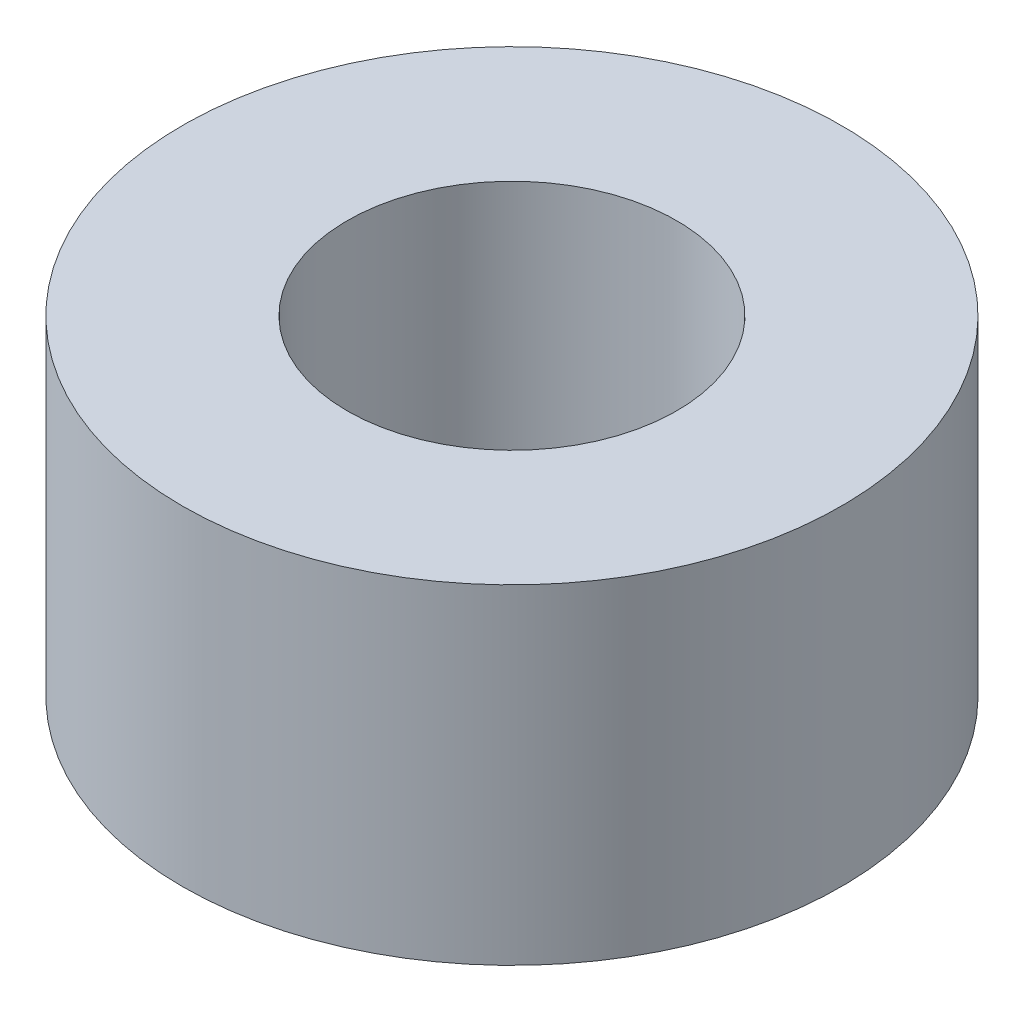
ISO-10303-21;
HEADER;
FILE_DESCRIPTION(('STEP AP214'),'2;1');
FILE_NAME('part.step','',(''),(''),'','','');
FILE_SCHEMA(('AUTOMOTIVE_DESIGN { 1 0 10303 214 1 1 1 1 }'));
ENDSEC;
DATA;
#1=APPLICATION_CONTEXT('core data for automotive mechanical design processes');
#2=APPLICATION_PROTOCOL_DEFINITION('international standard','automotive_design',2000,#1);
#3=PRODUCT_CONTEXT('',#1,'mechanical');
#4=PRODUCT('Part','Part','',(#3));
#5=PRODUCT_RELATED_PRODUCT_CATEGORY('part','',(#4));
#6=PRODUCT_DEFINITION_FORMATION('','',#4);
#7=PRODUCT_DEFINITION_CONTEXT('part definition',#1,'design');
#8=PRODUCT_DEFINITION('design','',#6,#7);
#9=PRODUCT_DEFINITION_SHAPE('','',#8);
#10=(LENGTH_UNIT() NAMED_UNIT(*) SI_UNIT(.MILLI.,.METRE.));
#11=(NAMED_UNIT(*) PLANE_ANGLE_UNIT() SI_UNIT($,.RADIAN.));
#12=(NAMED_UNIT(*) SI_UNIT($,.STERADIAN.) SOLID_ANGLE_UNIT());
#13=UNCERTAINTY_MEASURE_WITH_UNIT(LENGTH_MEASURE(1.E-05),#10,'distance_accuracy_value','');
#14=(GEOMETRIC_REPRESENTATION_CONTEXT(3) GLOBAL_UNCERTAINTY_ASSIGNED_CONTEXT((#13)) GLOBAL_UNIT_ASSIGNED_CONTEXT((#10,
#11,#12)) REPRESENTATION_CONTEXT('',''));
#15=CARTESIAN_POINT('',(0.,0.,0.));
#16=DIRECTION('',(0.,0.,1.));
#17=DIRECTION('',(1.,0.,0.));
#18=AXIS2_PLACEMENT_3D('',#15,#16,#17);
#19=CARTESIAN_POINT('',(0.,3.175,0.));
#20=DIRECTION('',(0.,1.,0.));
#21=DIRECTION('',(0.,0.,1.));
#22=AXIS2_PLACEMENT_3D('',#19,#20,#21);
#23=PLANE('',#22);
#24=CARTESIAN_POINT('',(0.,3.175,0.));
#25=DIRECTION('',(0.,1.,0.));
#26=DIRECTION('',(0.,0.,1.));
#27=AXIS2_PLACEMENT_3D('',#24,#25,#26);
#28=CIRCLE('',#27,6.35);
#29=CARTESIAN_POINT('',(0.,3.175,6.35));
#30=VERTEX_POINT('',#29);
#31=EDGE_CURVE('E12',#30,#30,#28,.T.);
#32=ORIENTED_EDGE('',*,*,#31,.T.);
#33=EDGE_LOOP('',(#32));
#34=FACE_BOUND('',#33,.T.);
#35=CARTESIAN_POINT('',(0.,3.175,0.));
#36=DIRECTION('',(0.,1.,0.));
#37=DIRECTION('',(0.,0.,1.));
#38=AXIS2_PLACEMENT_3D('',#35,#36,#37);
#39=CIRCLE('',#38,3.175);
#40=CARTESIAN_POINT('',(0.,3.175,3.175));
#41=VERTEX_POINT('',#40);
#42=EDGE_CURVE('E52',#41,#41,#39,.T.);
#43=ORIENTED_EDGE('',*,*,#42,.F.);
#44=EDGE_LOOP('',(#43));
#45=FACE_BOUND('',#44,.T.);
#46=ADVANCED_FACE('F41',(#34,#45),#23,.T.);
#47=CARTESIAN_POINT('',(0.,-3.175,0.));
#48=DIRECTION('',(0.,1.,0.));
#49=DIRECTION('',(0.,0.,1.));
#50=AXIS2_PLACEMENT_3D('',#47,#48,#49);
#51=PLANE('',#50);
#52=CARTESIAN_POINT('',(0.,-3.175,0.));
#53=DIRECTION('',(0.,1.,0.));
#54=DIRECTION('',(0.,0.,1.));
#55=AXIS2_PLACEMENT_3D('',#52,#53,#54);
#56=CIRCLE('',#55,6.35);
#57=CARTESIAN_POINT('',(0.,-3.175,6.35));
#58=VERTEX_POINT('',#57);
#59=EDGE_CURVE('E45',#58,#58,#56,.T.);
#60=ORIENTED_EDGE('',*,*,#59,.F.);
#61=EDGE_LOOP('',(#60));
#62=FACE_BOUND('',#61,.T.);
#63=CARTESIAN_POINT('',(0.,-3.175,0.));
#64=DIRECTION('',(0.,1.,0.));
#65=DIRECTION('',(0.,0.,1.));
#66=AXIS2_PLACEMENT_3D('',#63,#64,#65);
#67=CIRCLE('',#66,3.175);
#68=CARTESIAN_POINT('',(0.,-3.175,3.175));
#69=VERTEX_POINT('',#68);
#70=EDGE_CURVE('E54',#69,#69,#67,.T.);
#71=ORIENTED_EDGE('',*,*,#70,.T.);
#72=EDGE_LOOP('',(#71));
#73=FACE_BOUND('',#72,.T.);
#74=ADVANCED_FACE('F64',(#62,#73),#51,.F.);
#75=CARTESIAN_POINT('',(0.,3.175,0.));
#76=DIRECTION('',(0.,-1.,0.));
#77=DIRECTION('',(0.,0.,-1.));
#78=AXIS2_PLACEMENT_3D('',#75,#76,#77);
#79=CYLINDRICAL_SURFACE('',#78,6.35);
#80=ORIENTED_EDGE('',*,*,#31,.F.);
#81=EDGE_LOOP('',(#80));
#82=FACE_BOUND('',#81,.T.);
#83=ORIENTED_EDGE('',*,*,#59,.T.);
#84=EDGE_LOOP('',(#83));
#85=FACE_BOUND('',#84,.T.);
#86=ADVANCED_FACE('F43',(#82,#85),#79,.T.);
#87=CARTESIAN_POINT('',(0.,3.175,0.));
#88=DIRECTION('',(0.,-1.,0.));
#89=DIRECTION('',(0.,0.,-1.));
#90=AXIS2_PLACEMENT_3D('',#87,#88,#89);
#91=CYLINDRICAL_SURFACE('',#90,3.175);
#92=ORIENTED_EDGE('',*,*,#42,.T.);
#93=EDGE_LOOP('',(#92));
#94=FACE_BOUND('',#93,.T.);
#95=ORIENTED_EDGE('',*,*,#70,.F.);
#96=EDGE_LOOP('',(#95));
#97=FACE_BOUND('',#96,.T.);
#98=ADVANCED_FACE('F60',(#94,#97),#91,.F.);
#99=CLOSED_SHELL('',(#46,#74,#86,#98));
#100=MANIFOLD_SOLID_BREP('B2',#99);
#101=ADVANCED_BREP_SHAPE_REPRESENTATION('',(#18,#100),#14);
#102=SHAPE_DEFINITION_REPRESENTATION(#9,#101);
ENDSEC;
END-ISO-10303-21;
